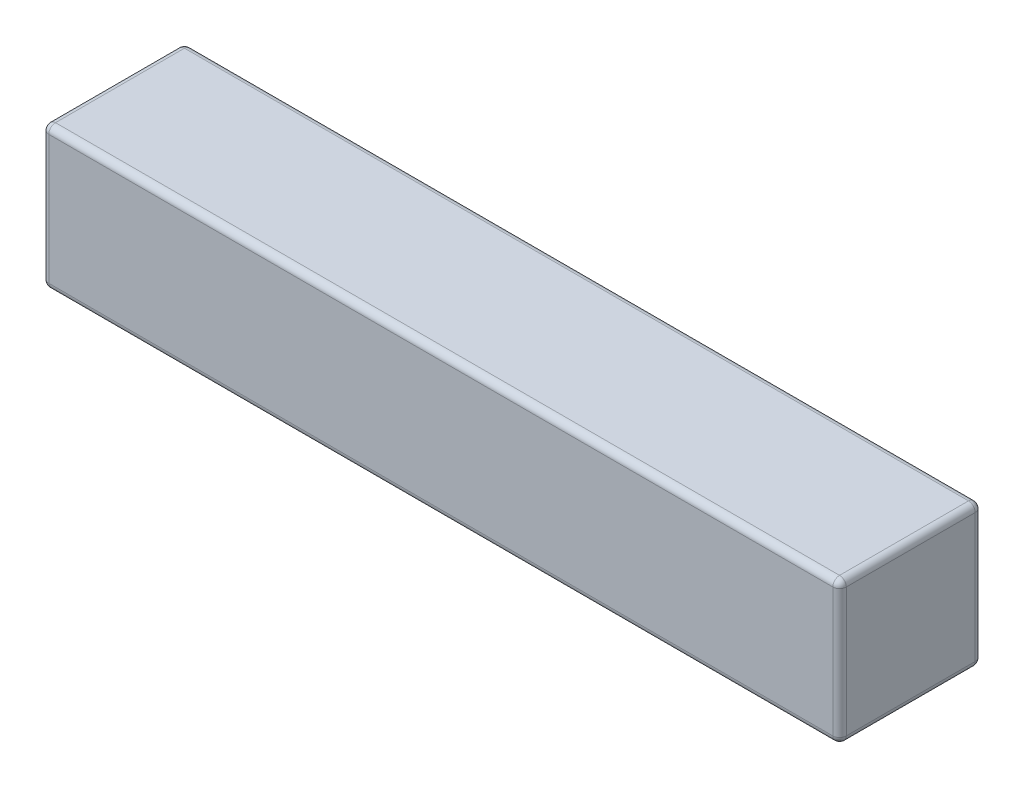
ISO-10303-21;
HEADER;
FILE_DESCRIPTION(('STEP AP214'),'2;1');
FILE_NAME('part.step','',(''),(''),'','','');
FILE_SCHEMA(('AUTOMOTIVE_DESIGN { 1 0 10303 214 1 1 1 1 }'));
ENDSEC;
DATA;
#1=APPLICATION_CONTEXT('core data for automotive mechanical design processes');
#2=APPLICATION_PROTOCOL_DEFINITION('international standard','automotive_design',2000,#1);
#3=PRODUCT_CONTEXT('',#1,'mechanical');
#4=PRODUCT('Part','Part','',(#3));
#5=PRODUCT_RELATED_PRODUCT_CATEGORY('part','',(#4));
#6=PRODUCT_DEFINITION_FORMATION('','',#4);
#7=PRODUCT_DEFINITION_CONTEXT('part definition',#1,'design');
#8=PRODUCT_DEFINITION('design','',#6,#7);
#9=PRODUCT_DEFINITION_SHAPE('','',#8);
#10=(LENGTH_UNIT() NAMED_UNIT(*) SI_UNIT(.MILLI.,.METRE.));
#11=(NAMED_UNIT(*) PLANE_ANGLE_UNIT() SI_UNIT($,.RADIAN.));
#12=(NAMED_UNIT(*) SI_UNIT($,.STERADIAN.) SOLID_ANGLE_UNIT());
#13=UNCERTAINTY_MEASURE_WITH_UNIT(LENGTH_MEASURE(1.E-05),#10,'distance_accuracy_value','');
#14=(GEOMETRIC_REPRESENTATION_CONTEXT(3) GLOBAL_UNCERTAINTY_ASSIGNED_CONTEXT((#13)) GLOBAL_UNIT_ASSIGNED_CONTEXT((#10,
#11,#12)) REPRESENTATION_CONTEXT('',''));
#15=CARTESIAN_POINT('',(0.,0.,0.));
#16=DIRECTION('',(0.,0.,1.));
#17=DIRECTION('',(1.,0.,0.));
#18=AXIS2_PLACEMENT_3D('',#15,#16,#17);
#19=CARTESIAN_POINT('',(13.85,-0.15,-3.2542396313364));
#20=DIRECTION('',(1.,0.,0.));
#21=DIRECTION('',(0.,1.,0.));
#22=AXIS2_PLACEMENT_3D('',#19,#20,#21);
#23=SPHERICAL_SURFACE('',#22,0.15);
#24=CARTESIAN_POINT('',(13.85,-0.15,-3.2542396313364));
#25=DIRECTION('',(0.,-1.,0.));
#26=DIRECTION('',(0.,0.,-1.));
#27=AXIS2_PLACEMENT_3D('',#24,#25,#26);
#28=CIRCLE('',#27,0.15);
#29=CARTESIAN_POINT('',(13.85,-0.15,-3.4042396313364));
#30=VERTEX_POINT('',#29);
#31=CARTESIAN_POINT('',(14.,-0.15,-3.2542396313364));
#32=VERTEX_POINT('',#31);
#33=EDGE_CURVE('E102',#30,#32,#28,.T.);
#34=ORIENTED_EDGE('',*,*,#33,.F.);
#35=CARTESIAN_POINT('',(13.85,-0.15,-3.2542396313364));
#36=DIRECTION('',(1.,0.,0.));
#37=DIRECTION('',(0.,0.,-1.));
#38=AXIS2_PLACEMENT_3D('',#35,#36,#37);
#39=CIRCLE('',#38,0.15);
#40=CARTESIAN_POINT('',(13.85,0.,-3.2542396313364));
#41=VERTEX_POINT('',#40);
#42=EDGE_CURVE('E276',#41,#30,#39,.F.);
#43=ORIENTED_EDGE('',*,*,#42,.F.);
#44=CARTESIAN_POINT('',(13.85,-0.15,-3.2542396313364));
#45=DIRECTION('',(0.,0.,1.));
#46=DIRECTION('',(1.,0.,0.));
#47=AXIS2_PLACEMENT_3D('',#44,#45,#46);
#48=CIRCLE('',#47,0.15);
#49=EDGE_CURVE('E278',#32,#41,#48,.T.);
#50=ORIENTED_EDGE('',*,*,#49,.F.);
#51=EDGE_LOOP('',(#34,#43,#50));
#52=FACE_BOUND('',#51,.T.);
#53=ADVANCED_FACE('F16',(#52),#23,.T.);
#54=CARTESIAN_POINT('',(-3.63,-0.15,-3.2542396313364));
#55=DIRECTION('',(1.,0.,0.));
#56=DIRECTION('',(0.,1.,0.));
#57=AXIS2_PLACEMENT_3D('',#54,#55,#56);
#58=SPHERICAL_SURFACE('',#57,0.15);
#59=CARTESIAN_POINT('',(-3.63,-0.15,-3.2542396313364));
#60=DIRECTION('',(0.,0.,-1.));
#61=DIRECTION('',(-1.,0.,0.));
#62=AXIS2_PLACEMENT_3D('',#59,#60,#61);
#63=CIRCLE('',#62,0.15);
#64=CARTESIAN_POINT('',(-3.63,0.,-3.2542396313364));
#65=VERTEX_POINT('',#64);
#66=CARTESIAN_POINT('',(-3.78,-0.15,-3.2542396313364));
#67=VERTEX_POINT('',#66);
#68=EDGE_CURVE('E269',#65,#67,#63,.F.);
#69=ORIENTED_EDGE('',*,*,#68,.F.);
#70=CARTESIAN_POINT('',(-3.63,-0.15,-3.2542396313364));
#71=DIRECTION('',(1.,0.,0.));
#72=DIRECTION('',(0.,0.,-1.));
#73=AXIS2_PLACEMENT_3D('',#70,#71,#72);
#74=CIRCLE('',#73,0.15);
#75=CARTESIAN_POINT('',(-3.63,-0.15,-3.4042396313364));
#76=VERTEX_POINT('',#75);
#77=EDGE_CURVE('E272',#76,#65,#74,.T.);
#78=ORIENTED_EDGE('',*,*,#77,.F.);
#79=CARTESIAN_POINT('',(-3.63,-0.15,-3.2542396313364));
#80=DIRECTION('',(0.,-1.,0.));
#81=DIRECTION('',(0.,0.,-1.));
#82=AXIS2_PLACEMENT_3D('',#79,#80,#81);
#83=CIRCLE('',#82,0.15);
#84=EDGE_CURVE('E263',#67,#76,#83,.T.);
#85=ORIENTED_EDGE('',*,*,#84,.F.);
#86=EDGE_LOOP('',(#69,#78,#85));
#87=FACE_BOUND('',#86,.T.);
#88=ADVANCED_FACE('F159',(#87),#58,.T.);
#89=CARTESIAN_POINT('',(13.85,-3.025,-3.2542396313364));
#90=DIRECTION('',(1.,0.,0.));
#91=DIRECTION('',(0.,1.,0.));
#92=AXIS2_PLACEMENT_3D('',#89,#90,#91);
#93=SPHERICAL_SURFACE('',#92,0.15);
#94=CARTESIAN_POINT('',(13.85,-3.025,-3.2542396313364));
#95=DIRECTION('',(-1.,0.,0.));
#96=DIRECTION('',(0.,0.,1.));
#97=AXIS2_PLACEMENT_3D('',#94,#95,#96);
#98=CIRCLE('',#97,0.15);
#99=CARTESIAN_POINT('',(13.85,-3.025,-3.4042396313364));
#100=VERTEX_POINT('',#99);
#101=CARTESIAN_POINT('',(13.85,-3.175,-3.25423963133487));
#102=VERTEX_POINT('',#101);
#103=EDGE_CURVE('E127',#100,#102,#98,.T.);
#104=ORIENTED_EDGE('',*,*,#103,.F.);
#105=CARTESIAN_POINT('',(13.85,-3.025,-3.2542396313364));
#106=DIRECTION('',(0.,-1.,0.));
#107=DIRECTION('',(0.,0.,-1.));
#108=AXIS2_PLACEMENT_3D('',#105,#106,#107);
#109=CIRCLE('',#108,0.15);
#110=CARTESIAN_POINT('',(14.,-3.025,-3.2542396313364));
#111=VERTEX_POINT('',#110);
#112=EDGE_CURVE('E119',#111,#100,#109,.F.);
#113=ORIENTED_EDGE('',*,*,#112,.F.);
#114=CARTESIAN_POINT('',(13.85,-3.025,-3.2542396313364));
#115=DIRECTION('',(0.,0.,-1.));
#116=DIRECTION('',(-1.,0.,0.));
#117=AXIS2_PLACEMENT_3D('',#114,#115,#116);
#118=CIRCLE('',#117,0.15);
#119=EDGE_CURVE('E135',#102,#111,#118,.F.);
#120=ORIENTED_EDGE('',*,*,#119,.F.);
#121=EDGE_LOOP('',(#104,#113,#120));
#122=FACE_BOUND('',#121,.T.);
#123=ADVANCED_FACE('F133',(#122),#93,.T.);
#124=CARTESIAN_POINT('',(14.,-3.175,-3.4042396313364));
#125=DIRECTION('',(0.,0.,-1.));
#126=DIRECTION('',(-1.,0.,0.));
#127=AXIS2_PLACEMENT_3D('',#124,#125,#126);
#128=PLANE('',#127);
#129=DIRECTION('',(0.,-1.,0.));
#130=VECTOR('',#129,1.);
#131=CARTESIAN_POINT('',(13.85,-3.175,-3.4042396313364));
#132=LINE('',#131,#130);
#133=EDGE_CURVE('E109',#100,#30,#132,.F.);
#134=ORIENTED_EDGE('',*,*,#133,.F.);
#135=DIRECTION('',(-1.,0.,0.));
#136=VECTOR('',#135,1.);
#137=CARTESIAN_POINT('',(14.,-3.025,-3.4042396313364));
#138=LINE('',#137,#136);
#139=CARTESIAN_POINT('',(-3.63,-3.02499999999923,-3.4042396313364));
#140=VERTEX_POINT('',#139);
#141=EDGE_CURVE('E113',#140,#100,#138,.F.);
#142=ORIENTED_EDGE('',*,*,#141,.F.);
#143=DIRECTION('',(0.,-1.,0.));
#144=VECTOR('',#143,1.);
#145=CARTESIAN_POINT('',(-3.63,-3.175,-3.4042396313364));
#146=LINE('',#145,#144);
#147=EDGE_CURVE('E261',#76,#140,#146,.T.);
#148=ORIENTED_EDGE('',*,*,#147,.F.);
#149=DIRECTION('',(1.,0.,0.));
#150=VECTOR('',#149,1.);
#151=CARTESIAN_POINT('',(-3.78,-0.15,-3.4042396313364));
#152=LINE('',#151,#150);
#153=EDGE_CURVE('E116',#30,#76,#152,.F.);
#154=ORIENTED_EDGE('',*,*,#153,.F.);
#155=EDGE_LOOP('',(#134,#142,#148,#154));
#156=FACE_BOUND('',#155,.T.);
#157=ADVANCED_FACE('F111',(#156),#128,.T.);
#158=CARTESIAN_POINT('',(-3.63,-3.025,-3.2542396313364));
#159=DIRECTION('',(1.,0.,0.));
#160=DIRECTION('',(0.,1.,0.));
#161=AXIS2_PLACEMENT_3D('',#158,#159,#160);
#162=SPHERICAL_SURFACE('',#161,0.15);
#163=CARTESIAN_POINT('',(-3.63,-3.025,-3.2542396313364));
#164=DIRECTION('',(0.,0.,1.));
#165=DIRECTION('',(1.,0.,0.));
#166=AXIS2_PLACEMENT_3D('',#163,#164,#165);
#167=CIRCLE('',#166,0.15);
#168=CARTESIAN_POINT('',(-3.78,-3.025,-3.2542396313364));
#169=VERTEX_POINT('',#168);
#170=CARTESIAN_POINT('',(-3.63,-3.175,-3.2542396313364));
#171=VERTEX_POINT('',#170);
#172=EDGE_CURVE('E130',#169,#171,#167,.T.);
#173=ORIENTED_EDGE('',*,*,#172,.F.);
#174=CARTESIAN_POINT('',(-3.63,-3.025,-3.2542396313364));
#175=DIRECTION('',(0.,-1.,0.));
#176=DIRECTION('',(0.,0.,-1.));
#177=AXIS2_PLACEMENT_3D('',#174,#175,#176);
#178=CIRCLE('',#177,0.15);
#179=EDGE_CURVE('E266',#140,#169,#178,.F.);
#180=ORIENTED_EDGE('',*,*,#179,.F.);
#181=CARTESIAN_POINT('',(-3.63,-3.025,-3.2542396313364));
#182=DIRECTION('',(-1.,0.,0.));
#183=DIRECTION('',(0.,0.,1.));
#184=AXIS2_PLACEMENT_3D('',#181,#182,#183);
#185=CIRCLE('',#184,0.15);
#186=EDGE_CURVE('E129',#171,#140,#185,.F.);
#187=ORIENTED_EDGE('',*,*,#186,.F.);
#188=EDGE_LOOP('',(#173,#180,#187));
#189=FACE_BOUND('',#188,.T.);
#190=ADVANCED_FACE('F150',(#189),#162,.T.);
#191=CARTESIAN_POINT('',(13.85,-3.175,-3.2542396313364));
#192=DIRECTION('',(0.,-1.,0.));
#193=DIRECTION('',(0.,0.,-1.));
#194=AXIS2_PLACEMENT_3D('',#191,#192,#193);
#195=CYLINDRICAL_SURFACE('',#194,0.15);
#196=ORIENTED_EDGE('',*,*,#33,.T.);
#197=DIRECTION('',(0.,1.,0.));
#198=VECTOR('',#197,1.);
#199=CARTESIAN_POINT('',(14.,-3.175,-3.2542396313364));
#200=LINE('',#199,#198);
#201=EDGE_CURVE('E141',#111,#32,#200,.T.);
#202=ORIENTED_EDGE('',*,*,#201,.F.);
#203=ORIENTED_EDGE('',*,*,#112,.T.);
#204=ORIENTED_EDGE('',*,*,#133,.T.);
#205=EDGE_LOOP('',(#196,#202,#203,#204));
#206=FACE_BOUND('',#205,.T.);
#207=ADVANCED_FACE('F139',(#206),#195,.T.);
#208=CARTESIAN_POINT('',(13.85,-0.15,-0.229239631336402));
#209=DIRECTION('',(0.,0.,1.));
#210=DIRECTION('',(1.,0.,0.));
#211=AXIS2_PLACEMENT_3D('',#208,#209,#210);
#212=CYLINDRICAL_SURFACE('',#211,0.15);
#213=ORIENTED_EDGE('',*,*,#49,.T.);
#214=DIRECTION('',(0.,0.,1.));
#215=VECTOR('',#214,1.);
#216=CARTESIAN_POINT('',(13.85,0.,-0.229239631336402));
#217=LINE('',#216,#215);
#218=CARTESIAN_POINT('',(13.85,0.,-0.379239631336402));
#219=VERTEX_POINT('',#218);
#220=EDGE_CURVE('E246',#219,#41,#217,.F.);
#221=ORIENTED_EDGE('',*,*,#220,.F.);
#222=CARTESIAN_POINT('',(13.85,-0.15,-0.379239631336402));
#223=DIRECTION('',(0.,0.,1.));
#224=DIRECTION('',(1.,0.,0.));
#225=AXIS2_PLACEMENT_3D('',#222,#223,#224);
#226=CIRCLE('',#225,0.15);
#227=CARTESIAN_POINT('',(14.,-0.15,-0.379239631336402));
#228=VERTEX_POINT('',#227);
#229=EDGE_CURVE('E248',#228,#219,#226,.T.);
#230=ORIENTED_EDGE('',*,*,#229,.F.);
#231=DIRECTION('',(0.,0.,-1.));
#232=VECTOR('',#231,1.);
#233=CARTESIAN_POINT('',(14.,-0.15,-0.229239631336402));
#234=LINE('',#233,#232);
#235=EDGE_CURVE('E251',#32,#228,#234,.F.);
#236=ORIENTED_EDGE('',*,*,#235,.F.);
#237=EDGE_LOOP('',(#213,#221,#230,#236));
#238=FACE_BOUND('',#237,.T.);
#239=ADVANCED_FACE('F282',(#238),#212,.T.);
#240=CARTESIAN_POINT('',(-3.78,-0.15,-3.2542396313364));
#241=DIRECTION('',(1.,0.,0.));
#242=DIRECTION('',(0.,0.,-1.));
#243=AXIS2_PLACEMENT_3D('',#240,#241,#242);
#244=CYLINDRICAL_SURFACE('',#243,0.15);
#245=ORIENTED_EDGE('',*,*,#77,.T.);
#246=DIRECTION('',(1.,0.,0.));
#247=VECTOR('',#246,1.);
#248=CARTESIAN_POINT('',(-3.78,0.,-3.2542396313364));
#249=LINE('',#248,#247);
#250=EDGE_CURVE('E347',#41,#65,#249,.F.);
#251=ORIENTED_EDGE('',*,*,#250,.F.);
#252=ORIENTED_EDGE('',*,*,#42,.T.);
#253=ORIENTED_EDGE('',*,*,#153,.T.);
#254=EDGE_LOOP('',(#245,#251,#252,#253));
#255=FACE_BOUND('',#254,.T.);
#256=ADVANCED_FACE('F344',(#255),#244,.T.);
#257=CARTESIAN_POINT('',(-3.63,-0.15,-0.229239631336402));
#258=DIRECTION('',(0.,0.,-1.));
#259=DIRECTION('',(-1.,0.,0.));
#260=AXIS2_PLACEMENT_3D('',#257,#258,#259);
#261=CYLINDRICAL_SURFACE('',#260,0.15);
#262=ORIENTED_EDGE('',*,*,#68,.T.);
#263=DIRECTION('',(0.,0.,1.));
#264=VECTOR('',#263,1.);
#265=CARTESIAN_POINT('',(-3.78,-0.15,-3.4042396313364));
#266=LINE('',#265,#264);
#267=CARTESIAN_POINT('',(-3.78,-0.15,-0.379239631336402));
#268=VERTEX_POINT('',#267);
#269=EDGE_CURVE('E219',#268,#67,#266,.F.);
#270=ORIENTED_EDGE('',*,*,#269,.F.);
#271=CARTESIAN_POINT('',(-3.63,-0.15,-0.379239631336402));
#272=DIRECTION('',(0.,0.,1.));
#273=DIRECTION('',(1.,0.,0.));
#274=AXIS2_PLACEMENT_3D('',#271,#272,#273);
#275=CIRCLE('',#274,0.15);
#276=CARTESIAN_POINT('',(-3.63,0.,-0.379239631336402));
#277=VERTEX_POINT('',#276);
#278=EDGE_CURVE('E222',#277,#268,#275,.T.);
#279=ORIENTED_EDGE('',*,*,#278,.F.);
#280=DIRECTION('',(0.,0.,1.));
#281=VECTOR('',#280,1.);
#282=CARTESIAN_POINT('',(-3.63,0.,-0.229239631336402));
#283=LINE('',#282,#281);
#284=EDGE_CURVE('E350',#65,#277,#283,.T.);
#285=ORIENTED_EDGE('',*,*,#284,.F.);
#286=EDGE_LOOP('',(#262,#270,#279,#285));
#287=FACE_BOUND('',#286,.T.);
#288=ADVANCED_FACE('F360',(#287),#261,.T.);
#289=CARTESIAN_POINT('',(-3.63,-3.175,-3.2542396313364));
#290=DIRECTION('',(0.,-1.,0.));
#291=DIRECTION('',(0.,0.,-1.));
#292=AXIS2_PLACEMENT_3D('',#289,#290,#291);
#293=CYLINDRICAL_SURFACE('',#292,0.15);
#294=ORIENTED_EDGE('',*,*,#84,.T.);
#295=ORIENTED_EDGE('',*,*,#147,.T.);
#296=ORIENTED_EDGE('',*,*,#179,.T.);
#297=DIRECTION('',(0.,1.,0.));
#298=VECTOR('',#297,1.);
#299=CARTESIAN_POINT('',(-3.78,-3.175,-3.2542396313364));
#300=LINE('',#299,#298);
#301=EDGE_CURVE('E216',#67,#169,#300,.F.);
#302=ORIENTED_EDGE('',*,*,#301,.F.);
#303=EDGE_LOOP('',(#294,#295,#296,#302));
#304=FACE_BOUND('',#303,.T.);
#305=ADVANCED_FACE('F342',(#304),#293,.T.);
#306=CARTESIAN_POINT('',(13.85,-3.025,-0.229239631336402));
#307=DIRECTION('',(0.,0.,-1.));
#308=DIRECTION('',(-1.,0.,0.));
#309=AXIS2_PLACEMENT_3D('',#306,#307,#308);
#310=CYLINDRICAL_SURFACE('',#309,0.15);
#311=ORIENTED_EDGE('',*,*,#119,.T.);
#312=DIRECTION('',(0.,0.,-1.));
#313=VECTOR('',#312,1.);
#314=CARTESIAN_POINT('',(14.,-3.025,-0.229239631336402));
#315=LINE('',#314,#313);
#316=CARTESIAN_POINT('',(14.,-3.025,-0.379239631336402));
#317=VERTEX_POINT('',#316);
#318=EDGE_CURVE('E255',#317,#111,#315,.T.);
#319=ORIENTED_EDGE('',*,*,#318,.F.);
#320=CARTESIAN_POINT('',(13.85,-3.025,-0.379239631336402));
#321=DIRECTION('',(0.,0.,-1.));
#322=DIRECTION('',(1.,0.,0.));
#323=AXIS2_PLACEMENT_3D('',#320,#321,#322);
#324=CIRCLE('',#323,0.15);
#325=CARTESIAN_POINT('',(13.85,-3.175,-0.379239631336402));
#326=VERTEX_POINT('',#325);
#327=EDGE_CURVE('E208',#326,#317,#324,.F.);
#328=ORIENTED_EDGE('',*,*,#327,.F.);
#329=DIRECTION('',(0.,0.,1.));
#330=VECTOR('',#329,1.);
#331=CARTESIAN_POINT('',(13.85,-3.175,-0.229239631336402));
#332=LINE('',#331,#330);
#333=EDGE_CURVE('E205',#326,#102,#332,.F.);
#334=ORIENTED_EDGE('',*,*,#333,.T.);
#335=EDGE_LOOP('',(#311,#319,#328,#334));
#336=FACE_BOUND('',#335,.T.);
#337=ADVANCED_FACE('F291',(#336),#310,.T.);
#338=CARTESIAN_POINT('',(14.,-3.025,-3.2542396313364));
#339=DIRECTION('',(-1.,0.,0.));
#340=DIRECTION('',(0.,0.,1.));
#341=AXIS2_PLACEMENT_3D('',#338,#339,#340);
#342=CYLINDRICAL_SURFACE('',#341,0.15);
#343=ORIENTED_EDGE('',*,*,#186,.T.);
#344=ORIENTED_EDGE('',*,*,#141,.T.);
#345=ORIENTED_EDGE('',*,*,#103,.T.);
#346=DIRECTION('',(1.,0.,0.));
#347=VECTOR('',#346,1.);
#348=CARTESIAN_POINT('',(-3.78,-3.175,-3.2542396313364));
#349=LINE('',#348,#347);
#350=EDGE_CURVE('E306',#102,#171,#349,.F.);
#351=ORIENTED_EDGE('',*,*,#350,.T.);
#352=EDGE_LOOP('',(#343,#344,#345,#351));
#353=FACE_BOUND('',#352,.T.);
#354=ADVANCED_FACE('F125',(#353),#342,.T.);
#355=CARTESIAN_POINT('',(-3.63,-3.025,-3.4042396313364));
#356=DIRECTION('',(0.,0.,1.));
#357=DIRECTION('',(1.,0.,0.));
#358=AXIS2_PLACEMENT_3D('',#355,#356,#357);
#359=CYLINDRICAL_SURFACE('',#358,0.15);
#360=ORIENTED_EDGE('',*,*,#172,.T.);
#361=DIRECTION('',(0.,0.,1.));
#362=VECTOR('',#361,1.);
#363=CARTESIAN_POINT('',(-3.63,-3.175,-0.229239631336402));
#364=LINE('',#363,#362);
#365=CARTESIAN_POINT('',(-3.63,-3.175,-0.379239631336306));
#366=VERTEX_POINT('',#365);
#367=EDGE_CURVE('E336',#171,#366,#364,.T.);
#368=ORIENTED_EDGE('',*,*,#367,.T.);
#369=CARTESIAN_POINT('',(-3.63,-3.025,-0.379239631336402));
#370=DIRECTION('',(0.,-2.55541177815717E-12,-1.));
#371=DIRECTION('',(1.,0.,0.));
#372=AXIS2_PLACEMENT_3D('',#369,#370,#371);
#373=CIRCLE('',#372,0.15);
#374=CARTESIAN_POINT('',(-3.78,-3.025,-0.379239631336402));
#375=VERTEX_POINT('',#374);
#376=EDGE_CURVE('E207',#375,#366,#373,.F.);
#377=ORIENTED_EDGE('',*,*,#376,.F.);
#378=DIRECTION('',(0.,0.,1.));
#379=VECTOR('',#378,1.);
#380=CARTESIAN_POINT('',(-3.78,-3.025,-3.4042396313364));
#381=LINE('',#380,#379);
#382=EDGE_CURVE('E213',#169,#375,#381,.T.);
#383=ORIENTED_EDGE('',*,*,#382,.F.);
#384=EDGE_LOOP('',(#360,#368,#377,#383));
#385=FACE_BOUND('',#384,.T.);
#386=ADVANCED_FACE('F339',(#385),#359,.T.);
#387=CARTESIAN_POINT('',(14.,-3.175,-0.229239631336402));
#388=DIRECTION('',(1.,0.,0.));
#389=DIRECTION('',(0.,0.,-1.));
#390=AXIS2_PLACEMENT_3D('',#387,#388,#389);
#391=PLANE('',#390);
#392=ORIENTED_EDGE('',*,*,#235,.T.);
#393=DIRECTION('',(0.,-1.,0.));
#394=VECTOR('',#393,1.);
#395=CARTESIAN_POINT('',(14.,-3.175,-0.379239631336402));
#396=LINE('',#395,#394);
#397=EDGE_CURVE('E288',#317,#228,#396,.F.);
#398=ORIENTED_EDGE('',*,*,#397,.F.);
#399=ORIENTED_EDGE('',*,*,#318,.T.);
#400=ORIENTED_EDGE('',*,*,#201,.T.);
#401=EDGE_LOOP('',(#392,#398,#399,#400));
#402=FACE_BOUND('',#401,.T.);
#403=ADVANCED_FACE('F240',(#402),#391,.T.);
#404=CARTESIAN_POINT('',(13.85,-0.15,-0.379239631336402));
#405=DIRECTION('',(1.,0.,0.));
#406=DIRECTION('',(0.,1.,0.));
#407=AXIS2_PLACEMENT_3D('',#404,#405,#406);
#408=SPHERICAL_SURFACE('',#407,0.15);
#409=CARTESIAN_POINT('',(13.85,-0.15,-0.379239631336402));
#410=DIRECTION('',(0.,-1.,0.));
#411=DIRECTION('',(0.,0.,-1.));
#412=AXIS2_PLACEMENT_3D('',#409,#410,#411);
#413=CIRCLE('',#412,0.15);
#414=CARTESIAN_POINT('',(13.85,-0.15,-0.229239631336402));
#415=VERTEX_POINT('',#414);
#416=EDGE_CURVE('E331',#228,#415,#413,.T.);
#417=ORIENTED_EDGE('',*,*,#416,.F.);
#418=ORIENTED_EDGE('',*,*,#229,.T.);
#419=CARTESIAN_POINT('',(13.85,-0.15,-0.379239631336402));
#420=DIRECTION('',(-1.,0.,0.));
#421=DIRECTION('',(0.,0.,1.));
#422=AXIS2_PLACEMENT_3D('',#419,#420,#421);
#423=CIRCLE('',#422,0.15);
#424=EDGE_CURVE('E325',#415,#219,#423,.T.);
#425=ORIENTED_EDGE('',*,*,#424,.F.);
#426=EDGE_LOOP('',(#417,#418,#425));
#427=FACE_BOUND('',#426,.T.);
#428=ADVANCED_FACE('F235',(#427),#408,.T.);
#429=CARTESIAN_POINT('',(-3.78,0.,-0.229239631336402));
#430=DIRECTION('',(0.,1.,0.));
#431=DIRECTION('',(0.,0.,1.));
#432=AXIS2_PLACEMENT_3D('',#429,#430,#431);
#433=PLANE('',#432);
#434=ORIENTED_EDGE('',*,*,#284,.T.);
#435=DIRECTION('',(-1.,0.,0.));
#436=VECTOR('',#435,1.);
#437=CARTESIAN_POINT('',(-3.78,0.,-0.379239631336402));
#438=LINE('',#437,#436);
#439=EDGE_CURVE('E322',#219,#277,#438,.T.);
#440=ORIENTED_EDGE('',*,*,#439,.F.);
#441=ORIENTED_EDGE('',*,*,#220,.T.);
#442=ORIENTED_EDGE('',*,*,#250,.T.);
#443=EDGE_LOOP('',(#434,#440,#441,#442));
#444=FACE_BOUND('',#443,.T.);
#445=ADVANCED_FACE('F231',(#444),#433,.T.);
#446=CARTESIAN_POINT('',(-3.63,-0.15,-0.379239631336402));
#447=DIRECTION('',(1.,0.,0.));
#448=DIRECTION('',(0.,1.,0.));
#449=AXIS2_PLACEMENT_3D('',#446,#447,#448);
#450=SPHERICAL_SURFACE('',#449,0.15);
#451=CARTESIAN_POINT('',(-3.63,-0.15,-0.379239631336402));
#452=DIRECTION('',(-1.,0.,0.));
#453=DIRECTION('',(0.,0.,1.));
#454=AXIS2_PLACEMENT_3D('',#451,#452,#453);
#455=CIRCLE('',#454,0.15);
#456=CARTESIAN_POINT('',(-3.63,-0.15,-0.229239631336402));
#457=VERTEX_POINT('',#456);
#458=EDGE_CURVE('E328',#277,#457,#455,.F.);
#459=ORIENTED_EDGE('',*,*,#458,.F.);
#460=ORIENTED_EDGE('',*,*,#278,.T.);
#461=CARTESIAN_POINT('',(-3.63,-0.15,-0.379239631336402));
#462=DIRECTION('',(0.,-1.,0.));
#463=DIRECTION('',(0.,0.,-1.));
#464=AXIS2_PLACEMENT_3D('',#461,#462,#463);
#465=CIRCLE('',#464,0.15);
#466=EDGE_CURVE('E317',#457,#268,#465,.T.);
#467=ORIENTED_EDGE('',*,*,#466,.F.);
#468=EDGE_LOOP('',(#459,#460,#467));
#469=FACE_BOUND('',#468,.T.);
#470=ADVANCED_FACE('F227',(#469),#450,.T.);
#471=CARTESIAN_POINT('',(-3.78,-3.175,-3.4042396313364));
#472=DIRECTION('',(-1.,0.,0.));
#473=DIRECTION('',(0.,0.,1.));
#474=AXIS2_PLACEMENT_3D('',#471,#472,#473);
#475=PLANE('',#474);
#476=ORIENTED_EDGE('',*,*,#382,.T.);
#477=DIRECTION('',(0.,-1.,0.));
#478=VECTOR('',#477,1.);
#479=CARTESIAN_POINT('',(-3.78,-3.175,-0.379239631336402));
#480=LINE('',#479,#478);
#481=EDGE_CURVE('E301',#268,#375,#480,.T.);
#482=ORIENTED_EDGE('',*,*,#481,.F.);
#483=ORIENTED_EDGE('',*,*,#269,.T.);
#484=ORIENTED_EDGE('',*,*,#301,.T.);
#485=EDGE_LOOP('',(#476,#482,#483,#484));
#486=FACE_BOUND('',#485,.T.);
#487=ADVANCED_FACE('F230',(#486),#475,.T.);
#488=CARTESIAN_POINT('',(13.85,-3.025,-0.379239631336402));
#489=DIRECTION('',(1.,0.,0.));
#490=DIRECTION('',(0.,1.,0.));
#491=AXIS2_PLACEMENT_3D('',#488,#489,#490);
#492=SPHERICAL_SURFACE('',#491,0.15);
#493=CARTESIAN_POINT('',(13.85,-3.025,-0.379239631336402));
#494=DIRECTION('',(1.,0.,0.));
#495=DIRECTION('',(0.,0.,-1.));
#496=AXIS2_PLACEMENT_3D('',#493,#494,#495);
#497=CIRCLE('',#496,0.15);
#498=CARTESIAN_POINT('',(13.85,-3.025,-0.229239631336402));
#499=VERTEX_POINT('',#498);
#500=EDGE_CURVE('E297',#326,#499,#497,.F.);
#501=ORIENTED_EDGE('',*,*,#500,.F.);
#502=ORIENTED_EDGE('',*,*,#327,.T.);
#503=CARTESIAN_POINT('',(13.85,-3.025,-0.379239631336402));
#504=DIRECTION('',(0.,-1.,0.));
#505=DIRECTION('',(0.,0.,-1.));
#506=AXIS2_PLACEMENT_3D('',#503,#504,#505);
#507=CIRCLE('',#506,0.15);
#508=EDGE_CURVE('E294',#499,#317,#507,.F.);
#509=ORIENTED_EDGE('',*,*,#508,.F.);
#510=EDGE_LOOP('',(#501,#502,#509));
#511=FACE_BOUND('',#510,.T.);
#512=ADVANCED_FACE('F199',(#511),#492,.T.);
#513=CARTESIAN_POINT('',(-3.63,-3.025,-0.379239631336402));
#514=DIRECTION('',(1.,0.,0.));
#515=DIRECTION('',(0.,1.,0.));
#516=AXIS2_PLACEMENT_3D('',#513,#514,#515);
#517=SPHERICAL_SURFACE('',#516,0.15);
#518=CARTESIAN_POINT('',(-3.63,-3.025,-0.379239631336402));
#519=DIRECTION('',(1.,0.,0.));
#520=DIRECTION('',(0.,0.,-1.));
#521=AXIS2_PLACEMENT_3D('',#518,#519,#520);
#522=CIRCLE('',#521,0.15);
#523=CARTESIAN_POINT('',(-3.63,-3.025,-0.229239631336402));
#524=VERTEX_POINT('',#523);
#525=EDGE_CURVE('E34',#524,#366,#522,.T.);
#526=ORIENTED_EDGE('',*,*,#525,.F.);
#527=CARTESIAN_POINT('',(-3.63,-3.025,-0.379239631336402));
#528=DIRECTION('',(0.,-1.,0.));
#529=DIRECTION('',(0.,0.,-1.));
#530=AXIS2_PLACEMENT_3D('',#527,#528,#529);
#531=CIRCLE('',#530,0.15);
#532=EDGE_CURVE('E320',#375,#524,#531,.F.);
#533=ORIENTED_EDGE('',*,*,#532,.F.);
#534=ORIENTED_EDGE('',*,*,#376,.T.);
#535=EDGE_LOOP('',(#526,#533,#534));
#536=FACE_BOUND('',#535,.T.);
#537=ADVANCED_FACE('F194',(#536),#517,.T.);
#538=CARTESIAN_POINT('',(-3.78,-3.175,-0.229239631336402));
#539=DIRECTION('',(0.,1.,0.));
#540=DIRECTION('',(0.,0.,1.));
#541=AXIS2_PLACEMENT_3D('',#538,#539,#540);
#542=PLANE('',#541);
#543=ORIENTED_EDGE('',*,*,#350,.F.);
#544=ORIENTED_EDGE('',*,*,#333,.F.);
#545=DIRECTION('',(1.,0.,0.));
#546=VECTOR('',#545,1.);
#547=CARTESIAN_POINT('',(-3.78,-3.175,-0.379239631336402));
#548=LINE('',#547,#546);
#549=EDGE_CURVE('E305',#366,#326,#548,.T.);
#550=ORIENTED_EDGE('',*,*,#549,.F.);
#551=ORIENTED_EDGE('',*,*,#367,.F.);
#552=EDGE_LOOP('',(#543,#544,#550,#551));
#553=FACE_BOUND('',#552,.T.);
#554=ADVANCED_FACE('F190',(#553),#542,.F.);
#555=CARTESIAN_POINT('',(13.85,-3.175,-0.379239631336402));
#556=DIRECTION('',(0.,-1.,0.));
#557=DIRECTION('',(0.,0.,-1.));
#558=AXIS2_PLACEMENT_3D('',#555,#556,#557);
#559=CYLINDRICAL_SURFACE('',#558,0.15);
#560=ORIENTED_EDGE('',*,*,#416,.T.);
#561=DIRECTION('',(0.,1.,0.));
#562=VECTOR('',#561,1.);
#563=CARTESIAN_POINT('',(13.85,-3.175,-0.229239631336402));
#564=LINE('',#563,#562);
#565=EDGE_CURVE('E307',#499,#415,#564,.T.);
#566=ORIENTED_EDGE('',*,*,#565,.F.);
#567=ORIENTED_EDGE('',*,*,#508,.T.);
#568=ORIENTED_EDGE('',*,*,#397,.T.);
#569=EDGE_LOOP('',(#560,#566,#567,#568));
#570=FACE_BOUND('',#569,.T.);
#571=ADVANCED_FACE('F186',(#570),#559,.T.);
#572=CARTESIAN_POINT('',(-3.78,-0.15,-0.379239631336402));
#573=DIRECTION('',(-1.,0.,0.));
#574=DIRECTION('',(0.,0.,1.));
#575=AXIS2_PLACEMENT_3D('',#572,#573,#574);
#576=CYLINDRICAL_SURFACE('',#575,0.15);
#577=ORIENTED_EDGE('',*,*,#424,.T.);
#578=ORIENTED_EDGE('',*,*,#439,.T.);
#579=ORIENTED_EDGE('',*,*,#458,.T.);
#580=DIRECTION('',(1.,0.,0.));
#581=VECTOR('',#580,1.);
#582=CARTESIAN_POINT('',(-3.78,-0.15,-0.229239631336402));
#583=LINE('',#582,#581);
#584=EDGE_CURVE('E310',#415,#457,#583,.F.);
#585=ORIENTED_EDGE('',*,*,#584,.F.);
#586=EDGE_LOOP('',(#577,#578,#579,#585));
#587=FACE_BOUND('',#586,.T.);
#588=ADVANCED_FACE('F182',(#587),#576,.T.);
#589=CARTESIAN_POINT('',(-3.63,-3.175,-0.379239631336402));
#590=DIRECTION('',(0.,-1.,0.));
#591=DIRECTION('',(0.,0.,-1.));
#592=AXIS2_PLACEMENT_3D('',#589,#590,#591);
#593=CYLINDRICAL_SURFACE('',#592,0.15);
#594=ORIENTED_EDGE('',*,*,#466,.T.);
#595=ORIENTED_EDGE('',*,*,#481,.T.);
#596=ORIENTED_EDGE('',*,*,#532,.T.);
#597=DIRECTION('',(0.,1.,0.));
#598=VECTOR('',#597,1.);
#599=CARTESIAN_POINT('',(-3.63,-3.175,-0.229239631336402));
#600=LINE('',#599,#598);
#601=EDGE_CURVE('E25',#457,#524,#600,.F.);
#602=ORIENTED_EDGE('',*,*,#601,.F.);
#603=EDGE_LOOP('',(#594,#595,#596,#602));
#604=FACE_BOUND('',#603,.T.);
#605=ADVANCED_FACE('F175',(#604),#593,.T.);
#606=CARTESIAN_POINT('',(-3.78,-3.025,-0.379239631336402));
#607=DIRECTION('',(1.,0.,0.));
#608=DIRECTION('',(0.,0.,-1.));
#609=AXIS2_PLACEMENT_3D('',#606,#607,#608);
#610=CYLINDRICAL_SURFACE('',#609,0.15);
#611=ORIENTED_EDGE('',*,*,#525,.T.);
#612=ORIENTED_EDGE('',*,*,#549,.T.);
#613=ORIENTED_EDGE('',*,*,#500,.T.);
#614=DIRECTION('',(1.,0.,0.));
#615=VECTOR('',#614,1.);
#616=CARTESIAN_POINT('',(-3.78,-3.025,-0.229239631336402));
#617=LINE('',#616,#615);
#618=EDGE_CURVE('E11',#524,#499,#617,.T.);
#619=ORIENTED_EDGE('',*,*,#618,.F.);
#620=EDGE_LOOP('',(#611,#612,#613,#619));
#621=FACE_BOUND('',#620,.T.);
#622=ADVANCED_FACE('F169',(#621),#610,.T.);
#623=CARTESIAN_POINT('',(-3.78,-3.175,-0.229239631336402));
#624=DIRECTION('',(0.,0.,1.));
#625=DIRECTION('',(1.,0.,0.));
#626=AXIS2_PLACEMENT_3D('',#623,#624,#625);
#627=PLANE('',#626);
#628=ORIENTED_EDGE('',*,*,#601,.T.);
#629=ORIENTED_EDGE('',*,*,#618,.T.);
#630=ORIENTED_EDGE('',*,*,#565,.T.);
#631=ORIENTED_EDGE('',*,*,#584,.T.);
#632=EDGE_LOOP('',(#628,#629,#630,#631));
#633=FACE_BOUND('',#632,.T.);
#634=ADVANCED_FACE('F167',(#633),#627,.T.);
#635=CLOSED_SHELL('',(#53,#88,#123,#157,#190,#207,#239,#256,#288,#305,#337,#354,#386,#403,#428,
#445,#470,#487,#512,#537,#554,#571,#588,#605,#622,#634));
#636=MANIFOLD_SOLID_BREP('B1',#635);
#637=ADVANCED_BREP_SHAPE_REPRESENTATION('',(#18,#636),#14);
#638=SHAPE_DEFINITION_REPRESENTATION(#9,#637);
ENDSEC;
END-ISO-10303-21;
